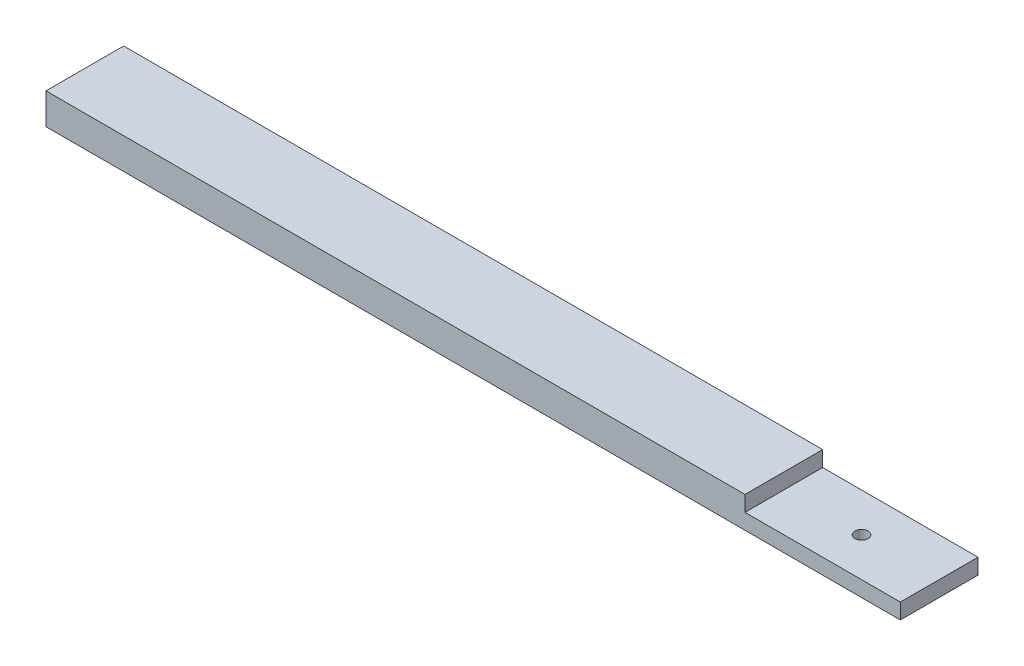
ISO-10303-21;
HEADER;
FILE_DESCRIPTION(('STEP AP214'),'2;1');
FILE_NAME('part.step','',(''),(''),'','','');
FILE_SCHEMA(('AUTOMOTIVE_DESIGN { 1 0 10303 214 1 1 1 1 }'));
ENDSEC;
DATA;
#1=APPLICATION_CONTEXT('core data for automotive mechanical design processes');
#2=APPLICATION_PROTOCOL_DEFINITION('international standard','automotive_design',2000,#1);
#3=PRODUCT_CONTEXT('',#1,'mechanical');
#4=PRODUCT('Part','Part','',(#3));
#5=PRODUCT_RELATED_PRODUCT_CATEGORY('part','',(#4));
#6=PRODUCT_DEFINITION_FORMATION('','',#4);
#7=PRODUCT_DEFINITION_CONTEXT('part definition',#1,'design');
#8=PRODUCT_DEFINITION('design','',#6,#7);
#9=PRODUCT_DEFINITION_SHAPE('','',#8);
#10=(LENGTH_UNIT() NAMED_UNIT(*) SI_UNIT(.MILLI.,.METRE.));
#11=(NAMED_UNIT(*) PLANE_ANGLE_UNIT() SI_UNIT($,.RADIAN.));
#12=(NAMED_UNIT(*) SI_UNIT($,.STERADIAN.) SOLID_ANGLE_UNIT());
#13=UNCERTAINTY_MEASURE_WITH_UNIT(LENGTH_MEASURE(1.E-05),#10,'distance_accuracy_value','');
#14=(GEOMETRIC_REPRESENTATION_CONTEXT(3) GLOBAL_UNCERTAINTY_ASSIGNED_CONTEXT((#13)) GLOBAL_UNIT_ASSIGNED_CONTEXT((#10,
#11,#12)) REPRESENTATION_CONTEXT('',''));
#15=CARTESIAN_POINT('',(0.,0.,0.));
#16=DIRECTION('',(0.,0.,1.));
#17=DIRECTION('',(1.,0.,0.));
#18=AXIS2_PLACEMENT_3D('',#15,#16,#17);
#19=CARTESIAN_POINT('',(69.85,5.08,-6.35));
#20=DIRECTION('',(-1.,0.,0.));
#21=DIRECTION('',(0.,0.,1.));
#22=AXIS2_PLACEMENT_3D('',#19,#20,#21);
#23=PLANE('',#22);
#24=DIRECTION('',(0.,-1.,0.));
#25=VECTOR('',#24,1.);
#26=CARTESIAN_POINT('',(69.85,5.08,-6.35));
#27=LINE('',#26,#25);
#28=CARTESIAN_POINT('',(69.85,2.54,-6.35));
#29=VERTEX_POINT('',#28);
#30=CARTESIAN_POINT('',(69.85,0.,-6.35));
#31=VERTEX_POINT('',#30);
#32=EDGE_CURVE('E47',#29,#31,#27,.T.);
#33=ORIENTED_EDGE('',*,*,#32,.F.);
#34=DIRECTION('',(0.,0.,1.));
#35=VECTOR('',#34,1.);
#36=CARTESIAN_POINT('',(69.85,2.54,-11.43));
#37=LINE('',#36,#35);
#38=CARTESIAN_POINT('',(69.85,2.54,6.35));
#39=VERTEX_POINT('',#38);
#40=EDGE_CURVE('E89',#29,#39,#37,.T.);
#41=ORIENTED_EDGE('',*,*,#40,.T.);
#42=DIRECTION('',(0.,-1.,0.));
#43=VECTOR('',#42,1.);
#44=CARTESIAN_POINT('',(69.85,5.08,6.35));
#45=LINE('',#44,#43);
#46=CARTESIAN_POINT('',(69.85,0.,6.35));
#47=VERTEX_POINT('',#46);
#48=EDGE_CURVE('E82',#39,#47,#45,.T.);
#49=ORIENTED_EDGE('',*,*,#48,.T.);
#50=DIRECTION('',(0.,0.,-1.));
#51=VECTOR('',#50,1.);
#52=CARTESIAN_POINT('',(69.85,0.,-6.35));
#53=LINE('',#52,#51);
#54=EDGE_CURVE('E86',#47,#31,#53,.T.);
#55=ORIENTED_EDGE('',*,*,#54,.T.);
#56=EDGE_LOOP('',(#33,#41,#49,#55));
#57=FACE_BOUND('',#56,.T.);
#58=ADVANCED_FACE('F39',(#57),#23,.F.);
#59=CARTESIAN_POINT('',(-69.85,5.08,-6.35));
#60=DIRECTION('',(0.,0.,1.));
#61=DIRECTION('',(1.,0.,0.));
#62=AXIS2_PLACEMENT_3D('',#59,#60,#61);
#63=PLANE('',#62);
#64=DIRECTION('',(0.,-1.,0.));
#65=VECTOR('',#64,1.);
#66=CARTESIAN_POINT('',(44.45,5.08,-6.35));
#67=LINE('',#66,#65);
#68=CARTESIAN_POINT('',(44.45,5.08,-6.35));
#69=VERTEX_POINT('',#68);
#70=CARTESIAN_POINT('',(44.45,2.54,-6.35));
#71=VERTEX_POINT('',#70);
#72=EDGE_CURVE('E53',#69,#71,#67,.T.);
#73=ORIENTED_EDGE('',*,*,#72,.T.);
#74=DIRECTION('',(1.,0.,0.));
#75=VECTOR('',#74,1.);
#76=CARTESIAN_POINT('',(-69.85,2.53999999999998,-6.35));
#77=LINE('',#76,#75);
#78=EDGE_CURVE('E111',#71,#29,#77,.T.);
#79=ORIENTED_EDGE('',*,*,#78,.T.);
#80=ORIENTED_EDGE('',*,*,#32,.T.);
#81=DIRECTION('',(-1.,0.,0.));
#82=VECTOR('',#81,1.);
#83=CARTESIAN_POINT('',(-69.85,0.,-6.35));
#84=LINE('',#83,#82);
#85=CARTESIAN_POINT('',(-69.85,0.,-6.35));
#86=VERTEX_POINT('',#85);
#87=EDGE_CURVE('E109',#31,#86,#84,.T.);
#88=ORIENTED_EDGE('',*,*,#87,.T.);
#89=DIRECTION('',(0.,-1.,0.));
#90=VECTOR('',#89,1.);
#91=CARTESIAN_POINT('',(-69.85,5.08,-6.35));
#92=LINE('',#91,#90);
#93=CARTESIAN_POINT('',(-69.85,5.08,-6.35));
#94=VERTEX_POINT('',#93);
#95=EDGE_CURVE('E125',#94,#86,#92,.T.);
#96=ORIENTED_EDGE('',*,*,#95,.F.);
#97=DIRECTION('',(-1.,0.,0.));
#98=VECTOR('',#97,1.);
#99=CARTESIAN_POINT('',(-69.85,5.08,-6.35));
#100=LINE('',#99,#98);
#101=EDGE_CURVE('E104',#69,#94,#100,.T.);
#102=ORIENTED_EDGE('',*,*,#101,.F.);
#103=EDGE_LOOP('',(#73,#79,#80,#88,#96,#102));
#104=FACE_BOUND('',#103,.T.);
#105=ADVANCED_FACE('F130',(#104),#63,.F.);
#106=CARTESIAN_POINT('',(-69.85,5.08,-6.35));
#107=DIRECTION('',(1.,0.,0.));
#108=DIRECTION('',(0.,0.,-1.));
#109=AXIS2_PLACEMENT_3D('',#106,#107,#108);
#110=PLANE('',#109);
#111=DIRECTION('',(0.,0.,1.));
#112=VECTOR('',#111,1.);
#113=CARTESIAN_POINT('',(-69.85,0.,-6.35));
#114=LINE('',#113,#112);
#115=CARTESIAN_POINT('',(-69.85,0.,6.35));
#116=VERTEX_POINT('',#115);
#117=EDGE_CURVE('E105',#86,#116,#114,.T.);
#118=ORIENTED_EDGE('',*,*,#117,.T.);
#119=DIRECTION('',(0.,-1.,0.));
#120=VECTOR('',#119,1.);
#121=CARTESIAN_POINT('',(-69.85,5.08,6.35));
#122=LINE('',#121,#120);
#123=CARTESIAN_POINT('',(-69.85,5.08,6.35));
#124=VERTEX_POINT('',#123);
#125=EDGE_CURVE('E93',#124,#116,#122,.T.);
#126=ORIENTED_EDGE('',*,*,#125,.F.);
#127=DIRECTION('',(0.,0.,1.));
#128=VECTOR('',#127,1.);
#129=CARTESIAN_POINT('',(-69.85,5.08,-6.35));
#130=LINE('',#129,#128);
#131=EDGE_CURVE('E62',#94,#124,#130,.T.);
#132=ORIENTED_EDGE('',*,*,#131,.F.);
#133=ORIENTED_EDGE('',*,*,#95,.T.);
#134=EDGE_LOOP('',(#118,#126,#132,#133));
#135=FACE_BOUND('',#134,.T.);
#136=ADVANCED_FACE('F182',(#135),#110,.F.);
#137=CARTESIAN_POINT('',(-69.85,5.08,6.35));
#138=DIRECTION('',(0.,0.,-1.));
#139=DIRECTION('',(-1.,0.,0.));
#140=AXIS2_PLACEMENT_3D('',#137,#138,#139);
#141=PLANE('',#140);
#142=ORIENTED_EDGE('',*,*,#48,.F.);
#143=DIRECTION('',(1.,0.,0.));
#144=VECTOR('',#143,1.);
#145=CARTESIAN_POINT('',(69.85,2.54,6.35));
#146=LINE('',#145,#144);
#147=CARTESIAN_POINT('',(44.45,2.54,6.35));
#148=VERTEX_POINT('',#147);
#149=EDGE_CURVE('E148',#148,#39,#146,.T.);
#150=ORIENTED_EDGE('',*,*,#149,.F.);
#151=DIRECTION('',(0.,-1.,0.));
#152=VECTOR('',#151,1.);
#153=CARTESIAN_POINT('',(44.45,5.08,6.35));
#154=LINE('',#153,#152);
#155=CARTESIAN_POINT('',(44.45,5.08,6.35));
#156=VERTEX_POINT('',#155);
#157=EDGE_CURVE('E146',#156,#148,#154,.T.);
#158=ORIENTED_EDGE('',*,*,#157,.F.);
#159=DIRECTION('',(1.,0.,0.));
#160=VECTOR('',#159,1.);
#161=CARTESIAN_POINT('',(-69.85,5.08,6.35));
#162=LINE('',#161,#160);
#163=EDGE_CURVE('E94',#124,#156,#162,.T.);
#164=ORIENTED_EDGE('',*,*,#163,.F.);
#165=ORIENTED_EDGE('',*,*,#125,.T.);
#166=DIRECTION('',(1.,0.,0.));
#167=VECTOR('',#166,1.);
#168=CARTESIAN_POINT('',(-69.85,0.,6.35));
#169=LINE('',#168,#167);
#170=EDGE_CURVE('E98',#116,#47,#169,.T.);
#171=ORIENTED_EDGE('',*,*,#170,.T.);
#172=EDGE_LOOP('',(#142,#150,#158,#164,#165,#171));
#173=FACE_BOUND('',#172,.T.);
#174=ADVANCED_FACE('F99',(#173),#141,.F.);
#175=CARTESIAN_POINT('',(0.,5.08,0.));
#176=DIRECTION('',(0.,1.,0.));
#177=DIRECTION('',(0.,0.,1.));
#178=AXIS2_PLACEMENT_3D('',#175,#176,#177);
#179=PLANE('',#178);
#180=DIRECTION('',(0.,0.,1.));
#181=VECTOR('',#180,1.);
#182=CARTESIAN_POINT('',(44.45,5.08,0.));
#183=LINE('',#182,#181);
#184=EDGE_CURVE('E11',#69,#156,#183,.T.);
#185=ORIENTED_EDGE('',*,*,#184,.F.);
#186=ORIENTED_EDGE('',*,*,#101,.T.);
#187=ORIENTED_EDGE('',*,*,#131,.T.);
#188=ORIENTED_EDGE('',*,*,#163,.T.);
#189=EDGE_LOOP('',(#185,#186,#187,#188));
#190=FACE_BOUND('',#189,.T.);
#191=ADVANCED_FACE('F152',(#190),#179,.T.);
#192=CARTESIAN_POINT('',(0.,0.,0.));
#193=DIRECTION('',(0.,1.,0.));
#194=DIRECTION('',(0.,0.,1.));
#195=AXIS2_PLACEMENT_3D('',#192,#193,#194);
#196=PLANE('',#195);
#197=CARTESIAN_POINT('',(57.15,0.,0.));
#198=DIRECTION('',(0.,1.,0.));
#199=DIRECTION('',(0.,0.,1.));
#200=AXIS2_PLACEMENT_3D('',#197,#198,#199);
#201=CIRCLE('',#200,1.0795);
#202=CARTESIAN_POINT('',(57.15,0.,1.0795));
#203=VERTEX_POINT('',#202);
#204=EDGE_CURVE('E150',#203,#203,#201,.T.);
#205=ORIENTED_EDGE('',*,*,#204,.T.);
#206=EDGE_LOOP('',(#205));
#207=FACE_BOUND('',#206,.T.);
#208=ORIENTED_EDGE('',*,*,#54,.F.);
#209=ORIENTED_EDGE('',*,*,#170,.F.);
#210=ORIENTED_EDGE('',*,*,#117,.F.);
#211=ORIENTED_EDGE('',*,*,#87,.F.);
#212=EDGE_LOOP('',(#208,#209,#210,#211));
#213=FACE_BOUND('',#212,.T.);
#214=ADVANCED_FACE('F108',(#207,#213),#196,.F.);
#215=CARTESIAN_POINT('',(69.85,2.54,-11.43));
#216=DIRECTION('',(0.,-1.,0.));
#217=DIRECTION('',(1.,0.,0.));
#218=AXIS2_PLACEMENT_3D('',#215,#216,#217);
#219=PLANE('',#218);
#220=CARTESIAN_POINT('',(57.15,2.54,0.));
#221=DIRECTION('',(0.,1.,0.));
#222=DIRECTION('',(-1.,0.,0.));
#223=AXIS2_PLACEMENT_3D('',#220,#221,#222);
#224=CIRCLE('',#223,1.0795);
#225=CARTESIAN_POINT('',(56.0705,2.54,0.));
#226=VERTEX_POINT('',#225);
#227=EDGE_CURVE('E170',#226,#226,#224,.T.);
#228=ORIENTED_EDGE('',*,*,#227,.F.);
#229=EDGE_LOOP('',(#228));
#230=FACE_BOUND('',#229,.T.);
#231=DIRECTION('',(0.,0.,1.));
#232=VECTOR('',#231,1.);
#233=CARTESIAN_POINT('',(44.45,2.54,-11.43));
#234=LINE('',#233,#232);
#235=EDGE_CURVE('E160',#71,#148,#234,.T.);
#236=ORIENTED_EDGE('',*,*,#235,.T.);
#237=ORIENTED_EDGE('',*,*,#149,.T.);
#238=ORIENTED_EDGE('',*,*,#40,.F.);
#239=ORIENTED_EDGE('',*,*,#78,.F.);
#240=EDGE_LOOP('',(#236,#237,#238,#239));
#241=FACE_BOUND('',#240,.T.);
#242=ADVANCED_FACE('F178',(#230,#241),#219,.F.);
#243=CARTESIAN_POINT('',(44.45,5.08,-11.43));
#244=DIRECTION('',(-1.,0.,0.));
#245=DIRECTION('',(0.,0.,1.));
#246=AXIS2_PLACEMENT_3D('',#243,#244,#245);
#247=PLANE('',#246);
#248=ORIENTED_EDGE('',*,*,#184,.T.);
#249=ORIENTED_EDGE('',*,*,#157,.T.);
#250=ORIENTED_EDGE('',*,*,#235,.F.);
#251=ORIENTED_EDGE('',*,*,#72,.F.);
#252=EDGE_LOOP('',(#248,#249,#250,#251));
#253=FACE_BOUND('',#252,.T.);
#254=ADVANCED_FACE('F145',(#253),#247,.F.);
#255=CARTESIAN_POINT('',(57.15,-15.24,0.));
#256=DIRECTION('',(0.,1.,0.));
#257=DIRECTION('',(-1.,0.,0.));
#258=AXIS2_PLACEMENT_3D('',#255,#256,#257);
#259=CYLINDRICAL_SURFACE('',#258,1.0795);
#260=ORIENTED_EDGE('',*,*,#227,.T.);
#261=EDGE_LOOP('',(#260));
#262=FACE_BOUND('',#261,.T.);
#263=ORIENTED_EDGE('',*,*,#204,.F.);
#264=EDGE_LOOP('',(#263));
#265=FACE_BOUND('',#264,.T.);
#266=ADVANCED_FACE('F175',(#262,#265),#259,.F.);
#267=CLOSED_SHELL('',(#58,#105,#136,#174,#191,#214,#242,#254,#266));
#268=MANIFOLD_SOLID_BREP('B2',#267);
#269=ADVANCED_BREP_SHAPE_REPRESENTATION('',(#18,#268),#14);
#270=SHAPE_DEFINITION_REPRESENTATION(#9,#269);
ENDSEC;
END-ISO-10303-21;
